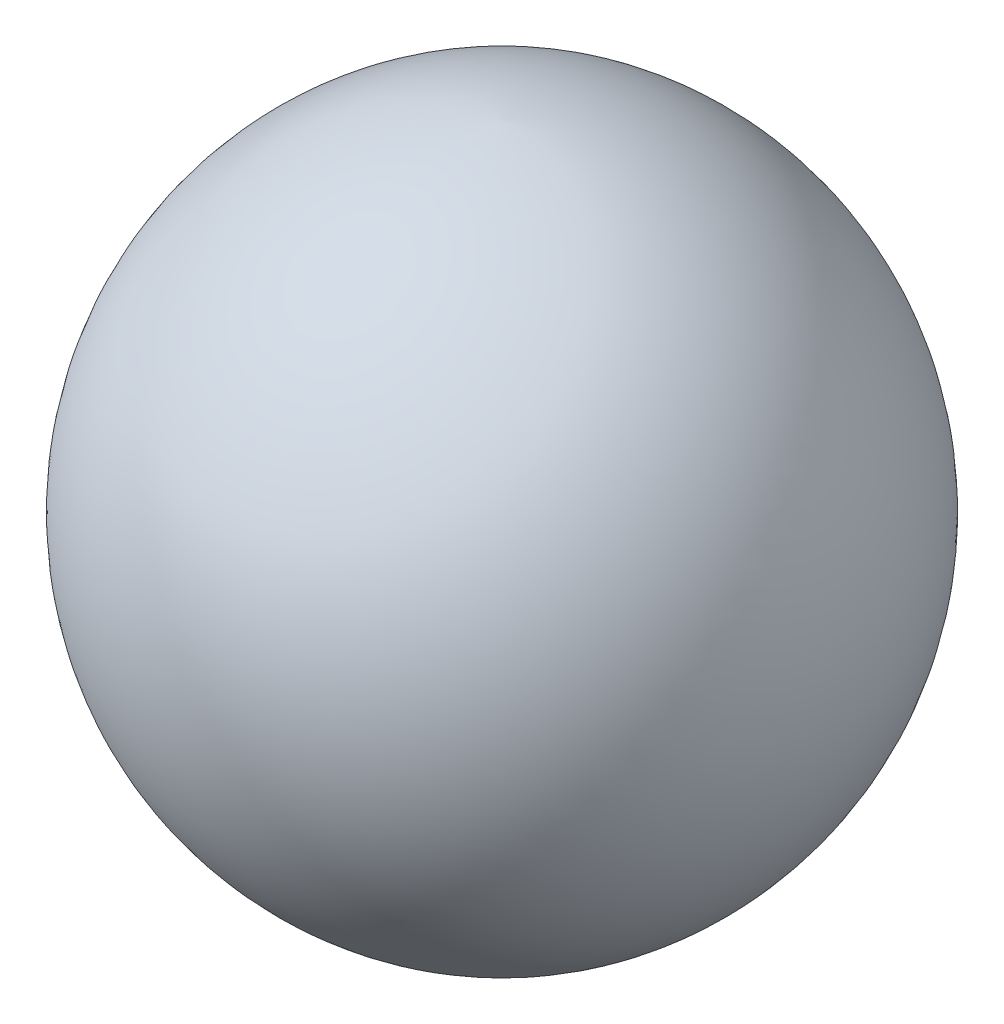
ISO-10303-21;
HEADER;
FILE_DESCRIPTION(('STEP AP214'),'2;1');
FILE_NAME('part.step','',(''),(''),'','','');
FILE_SCHEMA(('AUTOMOTIVE_DESIGN { 1 0 10303 214 1 1 1 1 }'));
ENDSEC;
DATA;
#1=APPLICATION_CONTEXT('core data for automotive mechanical design processes');
#2=APPLICATION_PROTOCOL_DEFINITION('international standard','automotive_design',2000,#1);
#3=PRODUCT_CONTEXT('',#1,'mechanical');
#4=PRODUCT('Part','Part','',(#3));
#5=PRODUCT_RELATED_PRODUCT_CATEGORY('part','',(#4));
#6=PRODUCT_DEFINITION_FORMATION('','',#4);
#7=PRODUCT_DEFINITION_CONTEXT('part definition',#1,'design');
#8=PRODUCT_DEFINITION('design','',#6,#7);
#9=PRODUCT_DEFINITION_SHAPE('','',#8);
#10=(LENGTH_UNIT() NAMED_UNIT(*) SI_UNIT(.MILLI.,.METRE.));
#11=(NAMED_UNIT(*) PLANE_ANGLE_UNIT() SI_UNIT($,.RADIAN.));
#12=(NAMED_UNIT(*) SI_UNIT($,.STERADIAN.) SOLID_ANGLE_UNIT());
#13=UNCERTAINTY_MEASURE_WITH_UNIT(LENGTH_MEASURE(1.E-05),#10,'distance_accuracy_value','');
#14=(GEOMETRIC_REPRESENTATION_CONTEXT(3) GLOBAL_UNCERTAINTY_ASSIGNED_CONTEXT((#13)) GLOBAL_UNIT_ASSIGNED_CONTEXT((#10,
#11,#12)) REPRESENTATION_CONTEXT('',''));
#15=CARTESIAN_POINT('',(0.,0.,0.));
#16=DIRECTION('',(0.,0.,1.));
#17=DIRECTION('',(1.,0.,0.));
#18=AXIS2_PLACEMENT_3D('',#15,#16,#17);
#19=CARTESIAN_POINT('',(0.,0.359526938239166,0.0184494086727987));
#20=DIRECTION('',(-1.,0.,0.));
#21=DIRECTION('',(0.,0.,-1.));
#22=AXIS2_PLACEMENT_3D('',#19,#20,#21);
#23=CIRCLE('',#22,0.36);
#24=TRIMMED_CURVE('',#23,(PARAMETER_VALUE(-1.51952550975154)),
(PARAMETER_VALUE(1.51952550975154)),.T.,.PARAMETER.);
#25=CARTESIAN_POINT('',(0.,0.359526938239166,0.));
#26=DIRECTION('',(0.,-1.,0.));
#27=AXIS1_PLACEMENT('',#25,#26);
#28=SURFACE_OF_REVOLUTION('',#24,#27);
#29=CARTESIAN_POINT('',(0.,0.,0.));
#30=VERTEX_POINT('',#29);
#31=VERTEX_LOOP('',#30);
#32=FACE_BOUND('',#31,.T.);
#33=CARTESIAN_POINT('',(0.,0.719053876478318,0.));
#34=VERTEX_POINT('',#33);
#35=VERTEX_LOOP('',#34);
#36=FACE_BOUND('',#35,.T.);
#37=ADVANCED_FACE('F28',(#32,#36),#28,.T.);
#38=CLOSED_SHELL('',(#37));
#39=MANIFOLD_SOLID_BREP('B2',#38);
#40=ADVANCED_BREP_SHAPE_REPRESENTATION('',(#18,#39),#14);
#41=SHAPE_DEFINITION_REPRESENTATION(#9,#40);
ENDSEC;
END-ISO-10303-21;
